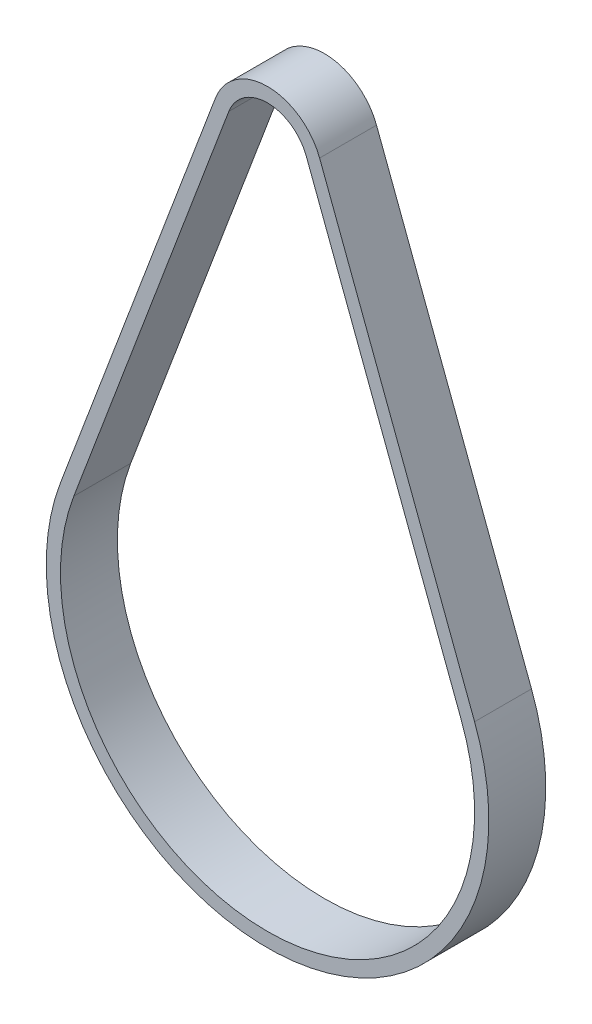
ISO-10303-21;
HEADER;
FILE_DESCRIPTION(('STEP AP214'),'2;1');
FILE_NAME('part.step','',(''),(''),'','','');
FILE_SCHEMA(('AUTOMOTIVE_DESIGN { 1 0 10303 214 1 1 1 1 }'));
ENDSEC;
DATA;
#1=APPLICATION_CONTEXT('core data for automotive mechanical design processes');
#2=APPLICATION_PROTOCOL_DEFINITION('international standard','automotive_design',2000,#1);
#3=PRODUCT_CONTEXT('',#1,'mechanical');
#4=PRODUCT('Part','Part','',(#3));
#5=PRODUCT_RELATED_PRODUCT_CATEGORY('part','',(#4));
#6=PRODUCT_DEFINITION_FORMATION('','',#4);
#7=PRODUCT_DEFINITION_CONTEXT('part definition',#1,'design');
#8=PRODUCT_DEFINITION('design','',#6,#7);
#9=PRODUCT_DEFINITION_SHAPE('','',#8);
#10=(LENGTH_UNIT() NAMED_UNIT(*) SI_UNIT(.MILLI.,.METRE.));
#11=(NAMED_UNIT(*) PLANE_ANGLE_UNIT() SI_UNIT($,.RADIAN.));
#12=(NAMED_UNIT(*) SI_UNIT($,.STERADIAN.) SOLID_ANGLE_UNIT());
#13=UNCERTAINTY_MEASURE_WITH_UNIT(LENGTH_MEASURE(1.E-05),#10,'distance_accuracy_value','');
#14=(GEOMETRIC_REPRESENTATION_CONTEXT(3) GLOBAL_UNCERTAINTY_ASSIGNED_CONTEXT((#13)) GLOBAL_UNIT_ASSIGNED_CONTEXT((#10,
#11,#12)) REPRESENTATION_CONTEXT('',''));
#15=CARTESIAN_POINT('',(0.,0.,0.));
#16=DIRECTION('',(0.,0.,1.));
#17=DIRECTION('',(1.,0.,0.));
#18=AXIS2_PLACEMENT_3D('',#15,#16,#17);
#19=CARTESIAN_POINT('',(0.,26.8063948233017,8.));
#20=DIRECTION('',(0.,0.,1.));
#21=DIRECTION('',(1.,0.,0.));
#22=AXIS2_PLACEMENT_3D('',#19,#20,#21);
#23=PLANE('',#22);
#24=CARTESIAN_POINT('',(0.,26.8063948233017,8.));
#25=DIRECTION('',(0.,0.,1.));
#26=DIRECTION('',(1.,0.,0.));
#27=AXIS2_PLACEMENT_3D('',#24,#25,#26);
#28=CIRCLE('',#27,7.81999999999999);
#29=CARTESIAN_POINT('',(7.31628348817592,29.5676256938818,8.));
#30=VERTEX_POINT('',#29);
#31=CARTESIAN_POINT('',(-7.31628348817593,29.5676256938818,8.));
#32=VERTEX_POINT('',#31);
#33=EDGE_CURVE('E135',#30,#32,#28,.T.);
#34=ORIENTED_EDGE('',*,*,#33,.T.);
#35=DIRECTION('',(-0.353098576800516,-0.935586123807664,0.));
#36=VECTOR('',#35,1.);
#37=CARTESIAN_POINT('',(-7.31628348817593,29.5676256938818,8.));
#38=LINE('',#37,#36);
#39=CARTESIAN_POINT('',(-29.1014063810374,-28.1552313866797,8.));
#40=VERTEX_POINT('',#39);
#41=EDGE_CURVE('E138',#32,#40,#38,.T.);
#42=ORIENTED_EDGE('',*,*,#41,.T.);
#43=CARTESIAN_POINT('',(0.,-39.1383626180598,8.));
#44=DIRECTION('',(0.,0.,1.));
#45=DIRECTION('',(1.,0.,0.));
#46=AXIS2_PLACEMENT_3D('',#43,#44,#45);
#47=CIRCLE('',#46,31.105);
#48=CARTESIAN_POINT('',(29.1014063810374,-28.1552313866797,8.));
#49=VERTEX_POINT('',#48);
#50=EDGE_CURVE('E141',#40,#49,#47,.T.);
#51=ORIENTED_EDGE('',*,*,#50,.T.);
#52=DIRECTION('',(-0.353098576800516,0.935586123807664,0.));
#53=VECTOR('',#52,1.);
#54=CARTESIAN_POINT('',(7.31628348817592,29.5676256938818,8.));
#55=LINE('',#54,#53);
#56=EDGE_CURVE('E143',#49,#30,#55,.T.);
#57=ORIENTED_EDGE('',*,*,#56,.T.);
#58=EDGE_LOOP('',(#34,#42,#51,#57));
#59=FACE_BOUND('',#58,.T.);
#60=DIRECTION('',(-0.353098576800516,0.935586123807664,0.));
#61=VECTOR('',#60,1.);
#62=CARTESIAN_POINT('',(5.4451112405606,28.8614285402807,8.));
#63=LINE('',#62,#61);
#64=CARTESIAN_POINT('',(27.2302341334221,-28.8614285402807,8.));
#65=VERTEX_POINT('',#64);
#66=CARTESIAN_POINT('',(5.4451112405606,28.8614285402807,8.));
#67=VERTEX_POINT('',#66);
#68=EDGE_CURVE('E107',#65,#67,#63,.T.);
#69=ORIENTED_EDGE('',*,*,#68,.F.);
#70=CARTESIAN_POINT('',(0.,-39.1383626180598,8.));
#71=DIRECTION('',(0.,0.,1.));
#72=DIRECTION('',(1.,0.,0.));
#73=AXIS2_PLACEMENT_3D('',#70,#71,#72);
#74=CIRCLE('',#73,29.105);
#75=CARTESIAN_POINT('',(-27.2302341334221,-28.8614285402807,8.));
#76=VERTEX_POINT('',#75);
#77=EDGE_CURVE('E99',#76,#65,#74,.T.);
#78=ORIENTED_EDGE('',*,*,#77,.F.);
#79=DIRECTION('',(-0.353098576800516,-0.935586123807664,0.));
#80=VECTOR('',#79,1.);
#81=CARTESIAN_POINT('',(-5.44511124056061,28.8614285402807,8.));
#82=LINE('',#81,#80);
#83=CARTESIAN_POINT('',(-5.44511124056061,28.8614285402807,8.));
#84=VERTEX_POINT('',#83);
#85=EDGE_CURVE('E121',#84,#76,#82,.T.);
#86=ORIENTED_EDGE('',*,*,#85,.F.);
#87=CARTESIAN_POINT('',(0.,26.8063948233017,8.));
#88=DIRECTION('',(0.,0.,1.));
#89=DIRECTION('',(1.,0.,0.));
#90=AXIS2_PLACEMENT_3D('',#87,#88,#89);
#91=CIRCLE('',#90,5.81999999999999);
#92=EDGE_CURVE('E119',#67,#84,#91,.T.);
#93=ORIENTED_EDGE('',*,*,#92,.F.);
#94=EDGE_LOOP('',(#69,#78,#86,#93));
#95=FACE_BOUND('',#94,.T.);
#96=ADVANCED_FACE('F34',(#59,#95),#23,.T.);
#97=CARTESIAN_POINT('',(0.,26.8063948233017,0.));
#98=DIRECTION('',(0.,0.,1.));
#99=DIRECTION('',(1.,0.,0.));
#100=AXIS2_PLACEMENT_3D('',#97,#98,#99);
#101=PLANE('',#100);
#102=CARTESIAN_POINT('',(0.,26.8063948233017,0.));
#103=DIRECTION('',(0.,0.,1.));
#104=DIRECTION('',(1.,0.,0.));
#105=AXIS2_PLACEMENT_3D('',#102,#103,#104);
#106=CIRCLE('',#105,7.81999999999999);
#107=CARTESIAN_POINT('',(7.31628348817592,29.5676256938818,0.));
#108=VERTEX_POINT('',#107);
#109=CARTESIAN_POINT('',(-7.31628348817593,29.5676256938818,0.));
#110=VERTEX_POINT('',#109);
#111=EDGE_CURVE('E115',#108,#110,#106,.T.);
#112=ORIENTED_EDGE('',*,*,#111,.F.);
#113=DIRECTION('',(-0.353098576800516,0.935586123807664,0.));
#114=VECTOR('',#113,1.);
#115=CARTESIAN_POINT('',(7.31628348817592,29.5676256938818,0.));
#116=LINE('',#115,#114);
#117=CARTESIAN_POINT('',(29.1014063810374,-28.1552313866797,0.));
#118=VERTEX_POINT('',#117);
#119=EDGE_CURVE('E139',#118,#108,#116,.T.);
#120=ORIENTED_EDGE('',*,*,#119,.F.);
#121=CARTESIAN_POINT('',(0.,-39.1383626180598,0.));
#122=DIRECTION('',(0.,0.,1.));
#123=DIRECTION('',(1.,0.,0.));
#124=AXIS2_PLACEMENT_3D('',#121,#122,#123);
#125=CIRCLE('',#124,31.105);
#126=CARTESIAN_POINT('',(-29.1014063810374,-28.1552313866797,0.));
#127=VERTEX_POINT('',#126);
#128=EDGE_CURVE('E150',#127,#118,#125,.T.);
#129=ORIENTED_EDGE('',*,*,#128,.F.);
#130=DIRECTION('',(-0.353098576800516,-0.935586123807664,0.));
#131=VECTOR('',#130,1.);
#132=CARTESIAN_POINT('',(-7.31628348817593,29.5676256938818,0.));
#133=LINE('',#132,#131);
#134=EDGE_CURVE('E148',#110,#127,#133,.T.);
#135=ORIENTED_EDGE('',*,*,#134,.F.);
#136=EDGE_LOOP('',(#112,#120,#129,#135));
#137=FACE_BOUND('',#136,.T.);
#138=CARTESIAN_POINT('',(0.,-39.1383626180598,0.));
#139=DIRECTION('',(0.,0.,1.));
#140=DIRECTION('',(1.,0.,0.));
#141=AXIS2_PLACEMENT_3D('',#138,#139,#140);
#142=CIRCLE('',#141,29.105);
#143=CARTESIAN_POINT('',(-27.2302341334221,-28.8614285402807,0.));
#144=VERTEX_POINT('',#143);
#145=CARTESIAN_POINT('',(27.2302341334221,-28.8614285402807,0.));
#146=VERTEX_POINT('',#145);
#147=EDGE_CURVE('E57',#144,#146,#142,.T.);
#148=ORIENTED_EDGE('',*,*,#147,.T.);
#149=DIRECTION('',(-0.353098576800516,0.935586123807664,0.));
#150=VECTOR('',#149,1.);
#151=CARTESIAN_POINT('',(5.4451112405606,28.8614285402807,0.));
#152=LINE('',#151,#150);
#153=CARTESIAN_POINT('',(5.4451112405606,28.8614285402807,0.));
#154=VERTEX_POINT('',#153);
#155=EDGE_CURVE('E114',#146,#154,#152,.T.);
#156=ORIENTED_EDGE('',*,*,#155,.T.);
#157=CARTESIAN_POINT('',(0.,26.8063948233017,0.));
#158=DIRECTION('',(0.,0.,1.));
#159=DIRECTION('',(1.,0.,0.));
#160=AXIS2_PLACEMENT_3D('',#157,#158,#159);
#161=CIRCLE('',#160,5.81999999999999);
#162=CARTESIAN_POINT('',(-5.44511124056061,28.8614285402807,0.));
#163=VERTEX_POINT('',#162);
#164=EDGE_CURVE('E127',#154,#163,#161,.T.);
#165=ORIENTED_EDGE('',*,*,#164,.T.);
#166=DIRECTION('',(-0.353098576800516,-0.935586123807664,0.));
#167=VECTOR('',#166,1.);
#168=CARTESIAN_POINT('',(-5.44511124056061,28.8614285402807,0.));
#169=LINE('',#168,#167);
#170=EDGE_CURVE('E108',#163,#144,#169,.T.);
#171=ORIENTED_EDGE('',*,*,#170,.T.);
#172=EDGE_LOOP('',(#148,#156,#165,#171));
#173=FACE_BOUND('',#172,.T.);
#174=ADVANCED_FACE('F168',(#137,#173),#101,.F.);
#175=CARTESIAN_POINT('',(0.,26.8063948233017,8.));
#176=DIRECTION('',(0.,0.,-1.));
#177=DIRECTION('',(-1.,0.,0.));
#178=AXIS2_PLACEMENT_3D('',#175,#176,#177);
#179=CYLINDRICAL_SURFACE('',#178,7.81999999999999);
#180=ORIENTED_EDGE('',*,*,#111,.T.);
#181=DIRECTION('',(0.,0.,-1.));
#182=VECTOR('',#181,1.);
#183=CARTESIAN_POINT('',(-7.31628348817593,29.5676256938818,8.));
#184=LINE('',#183,#182);
#185=EDGE_CURVE('E11',#32,#110,#184,.T.);
#186=ORIENTED_EDGE('',*,*,#185,.F.);
#187=ORIENTED_EDGE('',*,*,#33,.F.);
#188=DIRECTION('',(0.,0.,-1.));
#189=VECTOR('',#188,1.);
#190=CARTESIAN_POINT('',(7.31628348817592,29.5676256938818,8.));
#191=LINE('',#190,#189);
#192=EDGE_CURVE('E145',#30,#108,#191,.T.);
#193=ORIENTED_EDGE('',*,*,#192,.T.);
#194=EDGE_LOOP('',(#180,#186,#187,#193));
#195=FACE_BOUND('',#194,.T.);
#196=ADVANCED_FACE('F36',(#195),#179,.T.);
#197=CARTESIAN_POINT('',(-7.31628348817593,29.5676256938818,8.));
#198=DIRECTION('',(0.935586123807664,-0.353098576800517,0.));
#199=DIRECTION('',(0.353098576800517,0.935586123807664,0.));
#200=AXIS2_PLACEMENT_3D('',#197,#198,#199);
#201=PLANE('',#200);
#202=ORIENTED_EDGE('',*,*,#134,.T.);
#203=DIRECTION('',(0.,0.,-1.));
#204=VECTOR('',#203,1.);
#205=CARTESIAN_POINT('',(-29.1014063810374,-28.1552313866797,8.));
#206=LINE('',#205,#204);
#207=EDGE_CURVE('E42',#40,#127,#206,.T.);
#208=ORIENTED_EDGE('',*,*,#207,.F.);
#209=ORIENTED_EDGE('',*,*,#41,.F.);
#210=ORIENTED_EDGE('',*,*,#185,.T.);
#211=EDGE_LOOP('',(#202,#208,#209,#210));
#212=FACE_BOUND('',#211,.T.);
#213=ADVANCED_FACE('F178',(#212),#201,.F.);
#214=CARTESIAN_POINT('',(0.,-39.1383626180598,8.));
#215=DIRECTION('',(0.,0.,-1.));
#216=DIRECTION('',(-1.,0.,0.));
#217=AXIS2_PLACEMENT_3D('',#214,#215,#216);
#218=CYLINDRICAL_SURFACE('',#217,31.105);
#219=ORIENTED_EDGE('',*,*,#128,.T.);
#220=DIRECTION('',(0.,0.,-1.));
#221=VECTOR('',#220,1.);
#222=CARTESIAN_POINT('',(29.1014063810374,-28.1552313866797,8.));
#223=LINE('',#222,#221);
#224=EDGE_CURVE('E155',#49,#118,#223,.T.);
#225=ORIENTED_EDGE('',*,*,#224,.F.);
#226=ORIENTED_EDGE('',*,*,#50,.F.);
#227=ORIENTED_EDGE('',*,*,#207,.T.);
#228=EDGE_LOOP('',(#219,#225,#226,#227));
#229=FACE_BOUND('',#228,.T.);
#230=ADVANCED_FACE('F162',(#229),#218,.T.);
#231=CARTESIAN_POINT('',(7.31628348817592,29.5676256938818,8.));
#232=DIRECTION('',(-0.935586123807664,-0.353098576800516,0.));
#233=DIRECTION('',(0.353098576800516,-0.935586123807664,0.));
#234=AXIS2_PLACEMENT_3D('',#231,#232,#233);
#235=PLANE('',#234);
#236=ORIENTED_EDGE('',*,*,#119,.T.);
#237=ORIENTED_EDGE('',*,*,#192,.F.);
#238=ORIENTED_EDGE('',*,*,#56,.F.);
#239=ORIENTED_EDGE('',*,*,#224,.T.);
#240=EDGE_LOOP('',(#236,#237,#238,#239));
#241=FACE_BOUND('',#240,.T.);
#242=ADVANCED_FACE('F172',(#241),#235,.F.);
#243=CARTESIAN_POINT('',(0.,-39.1383626180598,8.));
#244=DIRECTION('',(0.,0.,-1.));
#245=DIRECTION('',(-1.,0.,0.));
#246=AXIS2_PLACEMENT_3D('',#243,#244,#245);
#247=CYLINDRICAL_SURFACE('',#246,29.105);
#248=ORIENTED_EDGE('',*,*,#147,.F.);
#249=DIRECTION('',(0.,0.,-1.));
#250=VECTOR('',#249,1.);
#251=CARTESIAN_POINT('',(-27.2302341334221,-28.8614285402807,8.));
#252=LINE('',#251,#250);
#253=EDGE_CURVE('E103',#76,#144,#252,.T.);
#254=ORIENTED_EDGE('',*,*,#253,.F.);
#255=ORIENTED_EDGE('',*,*,#77,.T.);
#256=DIRECTION('',(0.,0.,-1.));
#257=VECTOR('',#256,1.);
#258=CARTESIAN_POINT('',(27.2302341334221,-28.8614285402807,8.));
#259=LINE('',#258,#257);
#260=EDGE_CURVE('E102',#65,#146,#259,.T.);
#261=ORIENTED_EDGE('',*,*,#260,.T.);
#262=EDGE_LOOP('',(#248,#254,#255,#261));
#263=FACE_BOUND('',#262,.T.);
#264=ADVANCED_FACE('F101',(#263),#247,.F.);
#265=CARTESIAN_POINT('',(5.4451112405606,28.8614285402807,8.));
#266=DIRECTION('',(-0.935586123807664,-0.353098576800516,0.));
#267=DIRECTION('',(0.353098576800516,-0.935586123807664,0.));
#268=AXIS2_PLACEMENT_3D('',#265,#266,#267);
#269=PLANE('',#268);
#270=ORIENTED_EDGE('',*,*,#155,.F.);
#271=ORIENTED_EDGE('',*,*,#260,.F.);
#272=ORIENTED_EDGE('',*,*,#68,.T.);
#273=DIRECTION('',(0.,0.,-1.));
#274=VECTOR('',#273,1.);
#275=CARTESIAN_POINT('',(5.4451112405606,28.8614285402807,8.));
#276=LINE('',#275,#274);
#277=EDGE_CURVE('E116',#67,#154,#276,.T.);
#278=ORIENTED_EDGE('',*,*,#277,.T.);
#279=EDGE_LOOP('',(#270,#271,#272,#278));
#280=FACE_BOUND('',#279,.T.);
#281=ADVANCED_FACE('F111',(#280),#269,.T.);
#282=CARTESIAN_POINT('',(0.,26.8063948233017,8.));
#283=DIRECTION('',(0.,0.,-1.));
#284=DIRECTION('',(-1.,0.,0.));
#285=AXIS2_PLACEMENT_3D('',#282,#283,#284);
#286=CYLINDRICAL_SURFACE('',#285,5.81999999999999);
#287=ORIENTED_EDGE('',*,*,#164,.F.);
#288=ORIENTED_EDGE('',*,*,#277,.F.);
#289=ORIENTED_EDGE('',*,*,#92,.T.);
#290=DIRECTION('',(0.,0.,-1.));
#291=VECTOR('',#290,1.);
#292=CARTESIAN_POINT('',(-5.44511124056061,28.8614285402807,8.));
#293=LINE('',#292,#291);
#294=EDGE_CURVE('E49',#84,#163,#293,.T.);
#295=ORIENTED_EDGE('',*,*,#294,.T.);
#296=EDGE_LOOP('',(#287,#288,#289,#295));
#297=FACE_BOUND('',#296,.T.);
#298=ADVANCED_FACE('F201',(#297),#286,.F.);
#299=CARTESIAN_POINT('',(-5.44511124056061,28.8614285402807,8.));
#300=DIRECTION('',(0.935586123807664,-0.353098576800517,0.));
#301=DIRECTION('',(0.353098576800517,0.935586123807664,0.));
#302=AXIS2_PLACEMENT_3D('',#299,#300,#301);
#303=PLANE('',#302);
#304=ORIENTED_EDGE('',*,*,#170,.F.);
#305=ORIENTED_EDGE('',*,*,#294,.F.);
#306=ORIENTED_EDGE('',*,*,#85,.T.);
#307=ORIENTED_EDGE('',*,*,#253,.T.);
#308=EDGE_LOOP('',(#304,#305,#306,#307));
#309=FACE_BOUND('',#308,.T.);
#310=ADVANCED_FACE('F205',(#309),#303,.T.);
#311=CLOSED_SHELL('',(#96,#174,#196,#213,#230,#242,#264,#281,#298,#310));
#312=MANIFOLD_SOLID_BREP('B2',#311);
#313=ADVANCED_BREP_SHAPE_REPRESENTATION('',(#18,#312),#14);
#314=SHAPE_DEFINITION_REPRESENTATION(#9,#313);
ENDSEC;
END-ISO-10303-21;
